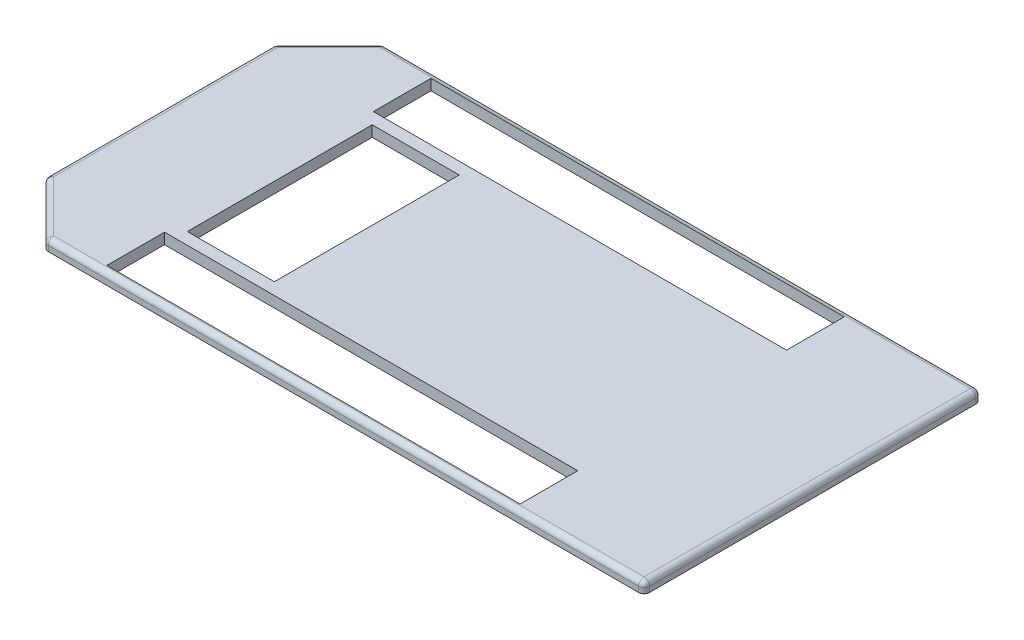
ISO-10303-21;
HEADER;
FILE_DESCRIPTION(('STEP AP214'),'2;1');
FILE_NAME('part.step','',(''),(''),'','','');
FILE_SCHEMA(('AUTOMOTIVE_DESIGN { 1 0 10303 214 1 1 1 1 }'));
ENDSEC;
DATA;
#1=APPLICATION_CONTEXT('core data for automotive mechanical design processes');
#2=APPLICATION_PROTOCOL_DEFINITION('international standard','automotive_design',2000,#1);
#3=PRODUCT_CONTEXT('',#1,'mechanical');
#4=PRODUCT('Part','Part','',(#3));
#5=PRODUCT_RELATED_PRODUCT_CATEGORY('part','',(#4));
#6=PRODUCT_DEFINITION_FORMATION('','',#4);
#7=PRODUCT_DEFINITION_CONTEXT('part definition',#1,'design');
#8=PRODUCT_DEFINITION('design','',#6,#7);
#9=PRODUCT_DEFINITION_SHAPE('','',#8);
#10=(LENGTH_UNIT() NAMED_UNIT(*) SI_UNIT(.MILLI.,.METRE.));
#11=(NAMED_UNIT(*) PLANE_ANGLE_UNIT() SI_UNIT($,.RADIAN.));
#12=(NAMED_UNIT(*) SI_UNIT($,.STERADIAN.) SOLID_ANGLE_UNIT());
#13=UNCERTAINTY_MEASURE_WITH_UNIT(LENGTH_MEASURE(1.E-05),#10,'distance_accuracy_value','');
#14=(GEOMETRIC_REPRESENTATION_CONTEXT(3) GLOBAL_UNCERTAINTY_ASSIGNED_CONTEXT((#13)) GLOBAL_UNIT_ASSIGNED_CONTEXT((#10,
#11,#12)) REPRESENTATION_CONTEXT('',''));
#15=CARTESIAN_POINT('',(0.,0.,0.));
#16=DIRECTION('',(0.,0.,1.));
#17=DIRECTION('',(1.,0.,0.));
#18=AXIS2_PLACEMENT_3D('',#15,#16,#17);
#19=CARTESIAN_POINT('',(300.,10.,-155.));
#20=DIRECTION('',(-1.,0.,0.));
#21=DIRECTION('',(0.,0.,1.));
#22=AXIS2_PLACEMENT_3D('',#19,#20,#21);
#23=PLANE('',#22);
#24=DIRECTION('',(0.,0.,-1.));
#25=VECTOR('',#24,1.);
#26=CARTESIAN_POINT('',(300.,0.,-155.));
#27=LINE('',#26,#25);
#28=CARTESIAN_POINT('',(300.,0.,150.));
#29=VERTEX_POINT('',#28);
#30=CARTESIAN_POINT('',(300.,0.,-150.));
#31=VERTEX_POINT('',#30);
#32=EDGE_CURVE('E358',#29,#31,#27,.T.);
#33=ORIENTED_EDGE('',*,*,#32,.T.);
#34=DIRECTION('',(0.,-1.,0.));
#35=VECTOR('',#34,1.);
#36=CARTESIAN_POINT('',(300.,10.,-150.));
#37=LINE('',#36,#35);
#38=CARTESIAN_POINT('',(300.,5.,-150.));
#39=VERTEX_POINT('',#38);
#40=EDGE_CURVE('E453',#31,#39,#37,.F.);
#41=ORIENTED_EDGE('',*,*,#40,.T.);
#42=DIRECTION('',(0.,0.,-1.));
#43=VECTOR('',#42,1.);
#44=CARTESIAN_POINT('',(300.,5.,155.));
#45=LINE('',#44,#43);
#46=CARTESIAN_POINT('',(300.,5.,150.));
#47=VERTEX_POINT('',#46);
#48=EDGE_CURVE('E450',#39,#47,#45,.F.);
#49=ORIENTED_EDGE('',*,*,#48,.T.);
#50=DIRECTION('',(0.,-1.,0.));
#51=VECTOR('',#50,1.);
#52=CARTESIAN_POINT('',(300.,10.,150.));
#53=LINE('',#52,#51);
#54=EDGE_CURVE('E447',#47,#29,#53,.T.);
#55=ORIENTED_EDGE('',*,*,#54,.T.);
#56=EDGE_LOOP('',(#33,#41,#49,#55));
#57=FACE_BOUND('',#56,.T.);
#58=ADVANCED_FACE('F38',(#57),#23,.F.);
#59=CARTESIAN_POINT('',(-250.,10.,-155.));
#60=DIRECTION('',(0.,0.,1.));
#61=DIRECTION('',(1.,0.,0.));
#62=AXIS2_PLACEMENT_3D('',#59,#60,#61);
#63=PLANE('',#62);
#64=DIRECTION('',(-1.,0.,0.));
#65=VECTOR('',#64,1.);
#66=CARTESIAN_POINT('',(300.,5.,-155.));
#67=LINE('',#66,#65);
#68=CARTESIAN_POINT('',(-247.928932188134,5.,-155.));
#69=VERTEX_POINT('',#68);
#70=CARTESIAN_POINT('',(295.,5.,-155.));
#71=VERTEX_POINT('',#70);
#72=EDGE_CURVE('E441',#69,#71,#67,.F.);
#73=ORIENTED_EDGE('',*,*,#72,.T.);
#74=DIRECTION('',(0.,-1.,0.));
#75=VECTOR('',#74,1.);
#76=CARTESIAN_POINT('',(295.,10.,-155.));
#77=LINE('',#76,#75);
#78=CARTESIAN_POINT('',(295.,0.,-155.));
#79=VERTEX_POINT('',#78);
#80=EDGE_CURVE('E444',#71,#79,#77,.T.);
#81=ORIENTED_EDGE('',*,*,#80,.T.);
#82=DIRECTION('',(-1.,0.,0.));
#83=VECTOR('',#82,1.);
#84=CARTESIAN_POINT('',(-250.,0.,-155.));
#85=LINE('',#84,#83);
#86=CARTESIAN_POINT('',(-247.928932188134,0.,-155.));
#87=VERTEX_POINT('',#86);
#88=EDGE_CURVE('E362',#79,#87,#85,.T.);
#89=ORIENTED_EDGE('',*,*,#88,.T.);
#90=DIRECTION('',(0.,-1.,0.));
#91=VECTOR('',#90,1.);
#92=CARTESIAN_POINT('',(-247.928932188134,10.,-155.));
#93=LINE('',#92,#91);
#94=EDGE_CURVE('E438',#87,#69,#93,.F.);
#95=ORIENTED_EDGE('',*,*,#94,.T.);
#96=EDGE_LOOP('',(#73,#81,#89,#95));
#97=FACE_BOUND('',#96,.T.);
#98=ADVANCED_FACE('F574',(#97),#63,.F.);
#99=CARTESIAN_POINT('',(-300.,10.,-105.));
#100=DIRECTION('',(0.707106781186548,0.,0.707106781186547));
#101=DIRECTION('',(0.707106781186547,0.,-0.707106781186548));
#102=AXIS2_PLACEMENT_3D('',#99,#100,#101);
#103=PLANE('',#102);
#104=DIRECTION('',(-0.707106781186547,0.,0.707106781186548));
#105=VECTOR('',#104,1.);
#106=CARTESIAN_POINT('',(-250.,5.,-155.));
#107=LINE('',#106,#105);
#108=CARTESIAN_POINT('',(-298.535533905933,5.,-106.464466094067));
#109=VERTEX_POINT('',#108);
#110=CARTESIAN_POINT('',(-251.464466094067,5.,-153.535533905933));
#111=VERTEX_POINT('',#110);
#112=EDGE_CURVE('E432',#109,#111,#107,.F.);
#113=ORIENTED_EDGE('',*,*,#112,.T.);
#114=DIRECTION('',(0.,-1.,0.));
#115=VECTOR('',#114,1.);
#116=CARTESIAN_POINT('',(-251.464466094067,10.,-153.535533905933));
#117=LINE('',#116,#115);
#118=CARTESIAN_POINT('',(-251.464466094067,0.,-153.535533905933));
#119=VERTEX_POINT('',#118);
#120=EDGE_CURVE('E435',#111,#119,#117,.T.);
#121=ORIENTED_EDGE('',*,*,#120,.T.);
#122=DIRECTION('',(-0.707106781186547,0.,0.707106781186548));
#123=VECTOR('',#122,1.);
#124=CARTESIAN_POINT('',(-300.,0.,-105.));
#125=LINE('',#124,#123);
#126=CARTESIAN_POINT('',(-298.535533905933,0.,-106.464466094067));
#127=VERTEX_POINT('',#126);
#128=EDGE_CURVE('E366',#119,#127,#125,.T.);
#129=ORIENTED_EDGE('',*,*,#128,.T.);
#130=DIRECTION('',(0.,-1.,0.));
#131=VECTOR('',#130,1.);
#132=CARTESIAN_POINT('',(-298.535533905933,10.,-106.464466094067));
#133=LINE('',#132,#131);
#134=EDGE_CURVE('E429',#127,#109,#133,.F.);
#135=ORIENTED_EDGE('',*,*,#134,.T.);
#136=EDGE_LOOP('',(#113,#121,#129,#135));
#137=FACE_BOUND('',#136,.T.);
#138=ADVANCED_FACE('F561',(#137),#103,.F.);
#139=CARTESIAN_POINT('',(-300.,10.,-105.));
#140=DIRECTION('',(1.,0.,0.));
#141=DIRECTION('',(0.,0.,-1.));
#142=AXIS2_PLACEMENT_3D('',#139,#140,#141);
#143=PLANE('',#142);
#144=DIRECTION('',(0.,0.,1.));
#145=VECTOR('',#144,1.);
#146=CARTESIAN_POINT('',(-300.,5.,-105.));
#147=LINE('',#146,#145);
#148=CARTESIAN_POINT('',(-300.,5.,102.928932188135));
#149=VERTEX_POINT('',#148);
#150=CARTESIAN_POINT('',(-300.,5.,-102.928932188135));
#151=VERTEX_POINT('',#150);
#152=EDGE_CURVE('E423',#149,#151,#147,.F.);
#153=ORIENTED_EDGE('',*,*,#152,.T.);
#154=DIRECTION('',(0.,-1.,0.));
#155=VECTOR('',#154,1.);
#156=CARTESIAN_POINT('',(-300.,10.,-102.928932188135));
#157=LINE('',#156,#155);
#158=CARTESIAN_POINT('',(-300.,0.,-102.928932188135));
#159=VERTEX_POINT('',#158);
#160=EDGE_CURVE('E426',#151,#159,#157,.T.);
#161=ORIENTED_EDGE('',*,*,#160,.T.);
#162=DIRECTION('',(0.,0.,1.));
#163=VECTOR('',#162,1.);
#164=CARTESIAN_POINT('',(-300.,0.,-105.));
#165=LINE('',#164,#163);
#166=CARTESIAN_POINT('',(-300.,0.,102.928932188135));
#167=VERTEX_POINT('',#166);
#168=EDGE_CURVE('E370',#159,#167,#165,.T.);
#169=ORIENTED_EDGE('',*,*,#168,.T.);
#170=DIRECTION('',(0.,-1.,0.));
#171=VECTOR('',#170,1.);
#172=CARTESIAN_POINT('',(-300.,10.,102.928932188135));
#173=LINE('',#172,#171);
#174=EDGE_CURVE('E420',#167,#149,#173,.F.);
#175=ORIENTED_EDGE('',*,*,#174,.T.);
#176=EDGE_LOOP('',(#153,#161,#169,#175));
#177=FACE_BOUND('',#176,.T.);
#178=ADVANCED_FACE('F650',(#177),#143,.F.);
#179=CARTESIAN_POINT('',(-300.,10.,105.));
#180=DIRECTION('',(0.707106781186548,0.,-0.707106781186547));
#181=DIRECTION('',(-0.707106781186547,0.,-0.707106781186548));
#182=AXIS2_PLACEMENT_3D('',#179,#180,#181);
#183=PLANE('',#182);
#184=DIRECTION('',(0.707106781186547,0.,0.707106781186548));
#185=VECTOR('',#184,1.);
#186=CARTESIAN_POINT('',(-300.,5.,105.));
#187=LINE('',#186,#185);
#188=CARTESIAN_POINT('',(-251.464466094067,5.,153.535533905933));
#189=VERTEX_POINT('',#188);
#190=CARTESIAN_POINT('',(-298.535533905933,5.,106.464466094067));
#191=VERTEX_POINT('',#190);
#192=EDGE_CURVE('E414',#189,#191,#187,.F.);
#193=ORIENTED_EDGE('',*,*,#192,.T.);
#194=DIRECTION('',(0.,-1.,0.));
#195=VECTOR('',#194,1.);
#196=CARTESIAN_POINT('',(-298.535533905933,10.,106.464466094067));
#197=LINE('',#196,#195);
#198=CARTESIAN_POINT('',(-298.535533905933,0.,106.464466094067));
#199=VERTEX_POINT('',#198);
#200=EDGE_CURVE('E417',#191,#199,#197,.T.);
#201=ORIENTED_EDGE('',*,*,#200,.T.);
#202=DIRECTION('',(0.707106781186547,0.,0.707106781186548));
#203=VECTOR('',#202,1.);
#204=CARTESIAN_POINT('',(-300.,0.,105.));
#205=LINE('',#204,#203);
#206=CARTESIAN_POINT('',(-251.464466094067,0.,153.535533905933));
#207=VERTEX_POINT('',#206);
#208=EDGE_CURVE('E374',#199,#207,#205,.T.);
#209=ORIENTED_EDGE('',*,*,#208,.T.);
#210=DIRECTION('',(0.,-1.,0.));
#211=VECTOR('',#210,1.);
#212=CARTESIAN_POINT('',(-251.464466094067,10.,153.535533905933));
#213=LINE('',#212,#211);
#214=EDGE_CURVE('E411',#207,#189,#213,.F.);
#215=ORIENTED_EDGE('',*,*,#214,.T.);
#216=EDGE_LOOP('',(#193,#201,#209,#215));
#217=FACE_BOUND('',#216,.T.);
#218=ADVANCED_FACE('F613',(#217),#183,.F.);
#219=CARTESIAN_POINT('',(-250.,10.,155.));
#220=DIRECTION('',(0.,0.,-1.));
#221=DIRECTION('',(-1.,0.,0.));
#222=AXIS2_PLACEMENT_3D('',#219,#220,#221);
#223=PLANE('',#222);
#224=DIRECTION('',(1.,0.,0.));
#225=VECTOR('',#224,1.);
#226=CARTESIAN_POINT('',(-250.,5.,155.));
#227=LINE('',#226,#225);
#228=CARTESIAN_POINT('',(295.,5.,155.));
#229=VERTEX_POINT('',#228);
#230=CARTESIAN_POINT('',(-247.928932188134,5.,155.));
#231=VERTEX_POINT('',#230);
#232=EDGE_CURVE('E404',#229,#231,#227,.F.);
#233=ORIENTED_EDGE('',*,*,#232,.T.);
#234=DIRECTION('',(0.,-1.,0.));
#235=VECTOR('',#234,1.);
#236=CARTESIAN_POINT('',(-247.928932188134,10.,155.));
#237=LINE('',#236,#235);
#238=CARTESIAN_POINT('',(-247.928932188134,0.,155.));
#239=VERTEX_POINT('',#238);
#240=EDGE_CURVE('E408',#231,#239,#237,.T.);
#241=ORIENTED_EDGE('',*,*,#240,.T.);
#242=DIRECTION('',(1.,0.,0.));
#243=VECTOR('',#242,1.);
#244=CARTESIAN_POINT('',(-250.,0.,155.));
#245=LINE('',#244,#243);
#246=CARTESIAN_POINT('',(295.,0.,155.));
#247=VERTEX_POINT('',#246);
#248=EDGE_CURVE('E378',#239,#247,#245,.T.);
#249=ORIENTED_EDGE('',*,*,#248,.T.);
#250=DIRECTION('',(0.,-1.,0.));
#251=VECTOR('',#250,1.);
#252=CARTESIAN_POINT('',(295.,10.,155.));
#253=LINE('',#252,#251);
#254=EDGE_CURVE('E401',#247,#229,#253,.F.);
#255=ORIENTED_EDGE('',*,*,#254,.T.);
#256=EDGE_LOOP('',(#233,#241,#249,#255));
#257=FACE_BOUND('',#256,.T.);
#258=ADVANCED_FACE('F604',(#257),#223,.F.);
#259=CARTESIAN_POINT('',(0.,10.,0.));
#260=DIRECTION('',(0.,1.,0.));
#261=DIRECTION('',(0.,0.,1.));
#262=AXIS2_PLACEMENT_3D('',#259,#260,#261);
#263=PLANE('',#262);
#264=DIRECTION('',(0.,0.,1.));
#265=VECTOR('',#264,1.);
#266=CARTESIAN_POINT('',(180.,10.,-149.));
#267=LINE('',#266,#265);
#268=CARTESIAN_POINT('',(180.,10.,-149.));
#269=VERTEX_POINT('',#268);
#270=CARTESIAN_POINT('',(180.,10.,-96.));
#271=VERTEX_POINT('',#270);
#272=EDGE_CURVE('E223',#269,#271,#267,.T.);
#273=ORIENTED_EDGE('',*,*,#272,.T.);
#274=DIRECTION('',(-1.,0.,0.));
#275=VECTOR('',#274,1.);
#276=CARTESIAN_POINT('',(180.,10.,-96.));
#277=LINE('',#276,#275);
#278=CARTESIAN_POINT('',(-200.,10.,-96.0000000000001));
#279=VERTEX_POINT('',#278);
#280=EDGE_CURVE('E235',#271,#279,#277,.T.);
#281=ORIENTED_EDGE('',*,*,#280,.T.);
#282=DIRECTION('',(0.,0.,-1.));
#283=VECTOR('',#282,1.);
#284=CARTESIAN_POINT('',(-200.,10.,-149.));
#285=LINE('',#284,#283);
#286=CARTESIAN_POINT('',(-200.,10.,-149.));
#287=VERTEX_POINT('',#286);
#288=EDGE_CURVE('E56',#279,#287,#285,.T.);
#289=ORIENTED_EDGE('',*,*,#288,.T.);
#290=DIRECTION('',(1.,0.,0.));
#291=VECTOR('',#290,1.);
#292=CARTESIAN_POINT('',(180.,10.,-149.));
#293=LINE('',#292,#291);
#294=EDGE_CURVE('E232',#287,#269,#293,.T.);
#295=ORIENTED_EDGE('',*,*,#294,.T.);
#296=EDGE_LOOP('',(#273,#281,#289,#295));
#297=FACE_BOUND('',#296,.T.);
#298=DIRECTION('',(0.,0.,1.));
#299=VECTOR('',#298,1.);
#300=CARTESIAN_POINT('',(180.,10.,149.));
#301=LINE('',#300,#299);
#302=CARTESIAN_POINT('',(180.,10.,96.));
#303=VERTEX_POINT('',#302);
#304=CARTESIAN_POINT('',(180.,10.,149.));
#305=VERTEX_POINT('',#304);
#306=EDGE_CURVE('E273',#303,#305,#301,.T.);
#307=ORIENTED_EDGE('',*,*,#306,.T.);
#308=DIRECTION('',(-1.,0.,0.));
#309=VECTOR('',#308,1.);
#310=CARTESIAN_POINT('',(180.,10.,149.));
#311=LINE('',#310,#309);
#312=CARTESIAN_POINT('',(-200.,10.,149.));
#313=VERTEX_POINT('',#312);
#314=EDGE_CURVE('E277',#305,#313,#311,.T.);
#315=ORIENTED_EDGE('',*,*,#314,.T.);
#316=DIRECTION('',(0.,0.,-1.));
#317=VECTOR('',#316,1.);
#318=CARTESIAN_POINT('',(-200.,10.,149.));
#319=LINE('',#318,#317);
#320=CARTESIAN_POINT('',(-200.,10.,96.0000000000001));
#321=VERTEX_POINT('',#320);
#322=EDGE_CURVE('E64',#313,#321,#319,.T.);
#323=ORIENTED_EDGE('',*,*,#322,.T.);
#324=DIRECTION('',(1.,0.,0.));
#325=VECTOR('',#324,1.);
#326=CARTESIAN_POINT('',(180.,10.,96.));
#327=LINE('',#326,#325);
#328=EDGE_CURVE('E284',#321,#303,#327,.T.);
#329=ORIENTED_EDGE('',*,*,#328,.T.);
#330=EDGE_LOOP('',(#307,#315,#323,#329));
#331=FACE_BOUND('',#330,.T.);
#332=DIRECTION('',(0.,0.,-1.));
#333=VECTOR('',#332,1.);
#334=CARTESIAN_POINT('',(-190.,10.,85.));
#335=LINE('',#334,#333);
#336=CARTESIAN_POINT('',(-190.,10.,85.));
#337=VERTEX_POINT('',#336);
#338=CARTESIAN_POINT('',(-190.,10.,-85.));
#339=VERTEX_POINT('',#338);
#340=EDGE_CURVE('E315',#337,#339,#335,.T.);
#341=ORIENTED_EDGE('',*,*,#340,.T.);
#342=DIRECTION('',(1.,0.,0.));
#343=VECTOR('',#342,1.);
#344=CARTESIAN_POINT('',(-190.,10.,-85.));
#345=LINE('',#344,#343);
#346=CARTESIAN_POINT('',(-110.,10.,-85.));
#347=VERTEX_POINT('',#346);
#348=EDGE_CURVE('E319',#339,#347,#345,.T.);
#349=ORIENTED_EDGE('',*,*,#348,.T.);
#350=DIRECTION('',(0.,0.,1.));
#351=VECTOR('',#350,1.);
#352=CARTESIAN_POINT('',(-110.,10.,85.));
#353=LINE('',#352,#351);
#354=CARTESIAN_POINT('',(-110.,10.,85.));
#355=VERTEX_POINT('',#354);
#356=EDGE_CURVE('E324',#347,#355,#353,.T.);
#357=ORIENTED_EDGE('',*,*,#356,.T.);
#358=DIRECTION('',(-1.,0.,0.));
#359=VECTOR('',#358,1.);
#360=CARTESIAN_POINT('',(-190.,10.,85.));
#361=LINE('',#360,#359);
#362=EDGE_CURVE('E328',#355,#337,#361,.T.);
#363=ORIENTED_EDGE('',*,*,#362,.T.);
#364=EDGE_LOOP('',(#341,#349,#357,#363));
#365=FACE_BOUND('',#364,.T.);
#366=DIRECTION('',(0.707106781186547,0.,0.707106781186548));
#367=VECTOR('',#366,1.);
#368=CARTESIAN_POINT('',(-246.464466094067,10.,151.464466094067));
#369=LINE('',#368,#367);
#370=CARTESIAN_POINT('',(-295.,10.,102.928932188135));
#371=VERTEX_POINT('',#370);
#372=CARTESIAN_POINT('',(-247.928932188135,10.,150.));
#373=VERTEX_POINT('',#372);
#374=EDGE_CURVE('E394',#371,#373,#369,.T.);
#375=ORIENTED_EDGE('',*,*,#374,.T.);
#376=DIRECTION('',(1.,0.,0.));
#377=VECTOR('',#376,1.);
#378=CARTESIAN_POINT('',(300.,10.,150.));
#379=LINE('',#378,#377);
#380=CARTESIAN_POINT('',(295.,10.,150.));
#381=VERTEX_POINT('',#380);
#382=EDGE_CURVE('E397',#373,#381,#379,.T.);
#383=ORIENTED_EDGE('',*,*,#382,.T.);
#384=DIRECTION('',(0.,0.,-1.));
#385=VECTOR('',#384,1.);
#386=CARTESIAN_POINT('',(295.,10.,-155.));
#387=LINE('',#386,#385);
#388=CARTESIAN_POINT('',(295.,10.,-150.));
#389=VERTEX_POINT('',#388);
#390=EDGE_CURVE('E382',#381,#389,#387,.T.);
#391=ORIENTED_EDGE('',*,*,#390,.T.);
#392=DIRECTION('',(-1.,0.,0.));
#393=VECTOR('',#392,1.);
#394=CARTESIAN_POINT('',(-250.,10.,-150.));
#395=LINE('',#394,#393);
#396=CARTESIAN_POINT('',(-247.928932188135,10.,-150.));
#397=VERTEX_POINT('',#396);
#398=EDGE_CURVE('E385',#389,#397,#395,.T.);
#399=ORIENTED_EDGE('',*,*,#398,.T.);
#400=DIRECTION('',(-0.707106781186547,0.,0.707106781186548));
#401=VECTOR('',#400,1.);
#402=CARTESIAN_POINT('',(-296.464466094067,10.,-101.464466094067));
#403=LINE('',#402,#401);
#404=CARTESIAN_POINT('',(-295.,10.,-102.928932188135));
#405=VERTEX_POINT('',#404);
#406=EDGE_CURVE('E388',#397,#405,#403,.T.);
#407=ORIENTED_EDGE('',*,*,#406,.T.);
#408=DIRECTION('',(0.,0.,1.));
#409=VECTOR('',#408,1.);
#410=CARTESIAN_POINT('',(-295.,10.,105.));
#411=LINE('',#410,#409);
#412=EDGE_CURVE('E391',#405,#371,#411,.T.);
#413=ORIENTED_EDGE('',*,*,#412,.T.);
#414=EDGE_LOOP('',(#375,#383,#391,#399,#407,#413));
#415=FACE_BOUND('',#414,.T.);
#416=ADVANCED_FACE('F240',(#297,#331,#365,#415),#263,.T.);
#417=CARTESIAN_POINT('',(0.,0.,0.));
#418=DIRECTION('',(0.,1.,0.));
#419=DIRECTION('',(0.,0.,1.));
#420=AXIS2_PLACEMENT_3D('',#417,#418,#419);
#421=PLANE('',#420);
#422=DIRECTION('',(-1.,0.,0.));
#423=VECTOR('',#422,1.);
#424=CARTESIAN_POINT('',(180.,0.,-96.));
#425=LINE('',#424,#423);
#426=CARTESIAN_POINT('',(180.,0.,-96.));
#427=VERTEX_POINT('',#426);
#428=CARTESIAN_POINT('',(-200.,0.,-96.0000000000001));
#429=VERTEX_POINT('',#428);
#430=EDGE_CURVE('E257',#427,#429,#425,.T.);
#431=ORIENTED_EDGE('',*,*,#430,.F.);
#432=DIRECTION('',(0.,0.,1.));
#433=VECTOR('',#432,1.);
#434=CARTESIAN_POINT('',(180.,0.,-149.));
#435=LINE('',#434,#433);
#436=CARTESIAN_POINT('',(180.,0.,-149.));
#437=VERTEX_POINT('',#436);
#438=EDGE_CURVE('E226',#437,#427,#435,.T.);
#439=ORIENTED_EDGE('',*,*,#438,.F.);
#440=DIRECTION('',(1.,0.,0.));
#441=VECTOR('',#440,1.);
#442=CARTESIAN_POINT('',(180.,0.,-149.));
#443=LINE('',#442,#441);
#444=CARTESIAN_POINT('',(-200.,0.,-149.));
#445=VERTEX_POINT('',#444);
#446=EDGE_CURVE('E244',#445,#437,#443,.T.);
#447=ORIENTED_EDGE('',*,*,#446,.F.);
#448=DIRECTION('',(0.,0.,-1.));
#449=VECTOR('',#448,1.);
#450=CARTESIAN_POINT('',(-200.,0.,-149.));
#451=LINE('',#450,#449);
#452=EDGE_CURVE('E248',#429,#445,#451,.T.);
#453=ORIENTED_EDGE('',*,*,#452,.F.);
#454=EDGE_LOOP('',(#431,#439,#447,#453));
#455=FACE_BOUND('',#454,.T.);
#456=DIRECTION('',(-1.,0.,0.));
#457=VECTOR('',#456,1.);
#458=CARTESIAN_POINT('',(180.,0.,149.));
#459=LINE('',#458,#457);
#460=CARTESIAN_POINT('',(180.,0.,149.));
#461=VERTEX_POINT('',#460);
#462=CARTESIAN_POINT('',(-200.,0.,149.));
#463=VERTEX_POINT('',#462);
#464=EDGE_CURVE('E292',#461,#463,#459,.T.);
#465=ORIENTED_EDGE('',*,*,#464,.F.);
#466=DIRECTION('',(0.,0.,1.));
#467=VECTOR('',#466,1.);
#468=CARTESIAN_POINT('',(180.,0.,149.));
#469=LINE('',#468,#467);
#470=CARTESIAN_POINT('',(180.,0.,96.));
#471=VERTEX_POINT('',#470);
#472=EDGE_CURVE('E289',#471,#461,#469,.T.);
#473=ORIENTED_EDGE('',*,*,#472,.F.);
#474=DIRECTION('',(1.,0.,0.));
#475=VECTOR('',#474,1.);
#476=CARTESIAN_POINT('',(180.,0.,96.));
#477=LINE('',#476,#475);
#478=CARTESIAN_POINT('',(-200.,0.,96.0000000000001));
#479=VERTEX_POINT('',#478);
#480=EDGE_CURVE('E278',#479,#471,#477,.T.);
#481=ORIENTED_EDGE('',*,*,#480,.F.);
#482=DIRECTION('',(0.,0.,-1.));
#483=VECTOR('',#482,1.);
#484=CARTESIAN_POINT('',(-200.,0.,149.));
#485=LINE('',#484,#483);
#486=EDGE_CURVE('E297',#463,#479,#485,.T.);
#487=ORIENTED_EDGE('',*,*,#486,.F.);
#488=EDGE_LOOP('',(#465,#473,#481,#487));
#489=FACE_BOUND('',#488,.T.);
#490=DIRECTION('',(1.,0.,0.));
#491=VECTOR('',#490,1.);
#492=CARTESIAN_POINT('',(-190.,0.,-85.));
#493=LINE('',#492,#491);
#494=CARTESIAN_POINT('',(-190.,0.,-85.));
#495=VERTEX_POINT('',#494);
#496=CARTESIAN_POINT('',(-110.,0.,-85.));
#497=VERTEX_POINT('',#496);
#498=EDGE_CURVE('E336',#495,#497,#493,.T.);
#499=ORIENTED_EDGE('',*,*,#498,.F.);
#500=DIRECTION('',(0.,0.,-1.));
#501=VECTOR('',#500,1.);
#502=CARTESIAN_POINT('',(-190.,0.,85.));
#503=LINE('',#502,#501);
#504=CARTESIAN_POINT('',(-190.,0.,85.));
#505=VERTEX_POINT('',#504);
#506=EDGE_CURVE('E333',#505,#495,#503,.T.);
#507=ORIENTED_EDGE('',*,*,#506,.F.);
#508=DIRECTION('',(-1.,0.,0.));
#509=VECTOR('',#508,1.);
#510=CARTESIAN_POINT('',(-190.,0.,85.));
#511=LINE('',#510,#509);
#512=CARTESIAN_POINT('',(-110.,0.,85.));
#513=VERTEX_POINT('',#512);
#514=EDGE_CURVE('E320',#513,#505,#511,.T.);
#515=ORIENTED_EDGE('',*,*,#514,.F.);
#516=DIRECTION('',(0.,0.,1.));
#517=VECTOR('',#516,1.);
#518=CARTESIAN_POINT('',(-110.,0.,85.));
#519=LINE('',#518,#517);
#520=EDGE_CURVE('E340',#497,#513,#519,.T.);
#521=ORIENTED_EDGE('',*,*,#520,.F.);
#522=EDGE_LOOP('',(#499,#507,#515,#521));
#523=FACE_BOUND('',#522,.T.);
#524=ORIENTED_EDGE('',*,*,#88,.F.);
#525=CARTESIAN_POINT('',(295.,0.,-150.));
#526=DIRECTION('',(0.,1.,0.));
#527=DIRECTION('',(0.,0.,1.));
#528=AXIS2_PLACEMENT_3D('',#525,#526,#527);
#529=CIRCLE('',#528,5.);
#530=EDGE_CURVE('E11',#79,#31,#529,.F.);
#531=ORIENTED_EDGE('',*,*,#530,.T.);
#532=ORIENTED_EDGE('',*,*,#32,.F.);
#533=CARTESIAN_POINT('',(295.,0.,150.));
#534=DIRECTION('',(0.,1.,0.));
#535=DIRECTION('',(0.,0.,1.));
#536=AXIS2_PLACEMENT_3D('',#533,#534,#535);
#537=CIRCLE('',#536,5.);
#538=EDGE_CURVE('E456',#29,#247,#537,.F.);
#539=ORIENTED_EDGE('',*,*,#538,.T.);
#540=ORIENTED_EDGE('',*,*,#248,.F.);
#541=CARTESIAN_POINT('',(-247.928932188134,0.,150.));
#542=DIRECTION('',(0.,1.,0.));
#543=DIRECTION('',(0.,0.,1.));
#544=AXIS2_PLACEMENT_3D('',#541,#542,#543);
#545=CIRCLE('',#544,5.);
#546=EDGE_CURVE('E459',#239,#207,#545,.F.);
#547=ORIENTED_EDGE('',*,*,#546,.T.);
#548=ORIENTED_EDGE('',*,*,#208,.F.);
#549=CARTESIAN_POINT('',(-295.,0.,102.928932188135));
#550=DIRECTION('',(0.,1.,0.));
#551=DIRECTION('',(0.,0.,1.));
#552=AXIS2_PLACEMENT_3D('',#549,#550,#551);
#553=CIRCLE('',#552,5.);
#554=EDGE_CURVE('E462',#199,#167,#553,.F.);
#555=ORIENTED_EDGE('',*,*,#554,.T.);
#556=ORIENTED_EDGE('',*,*,#168,.F.);
#557=CARTESIAN_POINT('',(-295.,0.,-102.928932188135));
#558=DIRECTION('',(0.,1.,0.));
#559=DIRECTION('',(0.,0.,1.));
#560=AXIS2_PLACEMENT_3D('',#557,#558,#559);
#561=CIRCLE('',#560,5.);
#562=EDGE_CURVE('E465',#159,#127,#561,.F.);
#563=ORIENTED_EDGE('',*,*,#562,.T.);
#564=ORIENTED_EDGE('',*,*,#128,.F.);
#565=CARTESIAN_POINT('',(-247.928932188134,0.,-150.));
#566=DIRECTION('',(0.,1.,0.));
#567=DIRECTION('',(0.,0.,1.));
#568=AXIS2_PLACEMENT_3D('',#565,#566,#567);
#569=CIRCLE('',#568,5.);
#570=EDGE_CURVE('E48',#119,#87,#569,.F.);
#571=ORIENTED_EDGE('',*,*,#570,.T.);
#572=EDGE_LOOP('',(#524,#531,#532,#539,#540,#547,#548,#555,#556,#563,#564,#571));
#573=FACE_BOUND('',#572,.T.);
#574=ADVANCED_FACE('F571',(#455,#489,#523,#573),#421,.F.);
#575=CARTESIAN_POINT('',(-295.,10.,-102.928932188135));
#576=DIRECTION('',(0.,-1.,0.));
#577=DIRECTION('',(0.,0.,-1.));
#578=AXIS2_PLACEMENT_3D('',#575,#576,#577);
#579=CYLINDRICAL_SURFACE('',#578,5.);
#580=ORIENTED_EDGE('',*,*,#562,.F.);
#581=ORIENTED_EDGE('',*,*,#160,.F.);
#582=CARTESIAN_POINT('',(-295.,5.,-102.928932188135));
#583=DIRECTION('',(0.,1.,0.));
#584=DIRECTION('',(0.,0.,1.));
#585=AXIS2_PLACEMENT_3D('',#582,#583,#584);
#586=CIRCLE('',#585,5.);
#587=EDGE_CURVE('E42',#109,#151,#586,.T.);
#588=ORIENTED_EDGE('',*,*,#587,.F.);
#589=ORIENTED_EDGE('',*,*,#134,.F.);
#590=EDGE_LOOP('',(#580,#581,#588,#589));
#591=FACE_BOUND('',#590,.T.);
#592=ADVANCED_FACE('F40',(#591),#579,.T.);
#593=CARTESIAN_POINT('',(-198.964466094067,5.,-198.964466094067));
#594=DIRECTION('',(0.707106781186547,0.,-0.707106781186548));
#595=DIRECTION('',(-0.707106781186548,0.,-0.707106781186547));
#596=AXIS2_PLACEMENT_3D('',#593,#594,#595);
#597=CYLINDRICAL_SURFACE('',#596,5.);
#598=CARTESIAN_POINT('',(-247.928932188135,5.,-150.));
#599=DIRECTION('',(0.707106781186548,0.,-0.707106781186548));
#600=DIRECTION('',(-0.707106781186548,0.,-0.707106781186548));
#601=AXIS2_PLACEMENT_3D('',#598,#599,#600);
#602=CIRCLE('',#601,5.);
#603=EDGE_CURVE('E527',#111,#397,#602,.T.);
#604=ORIENTED_EDGE('',*,*,#603,.F.);
#605=ORIENTED_EDGE('',*,*,#112,.F.);
#606=CARTESIAN_POINT('',(-295.,5.,-102.928932188135));
#607=DIRECTION('',(-0.707106781186542,0.,0.707106781186553));
#608=DIRECTION('',(0.707106781186553,0.,0.707106781186542));
#609=AXIS2_PLACEMENT_3D('',#606,#607,#608);
#610=CIRCLE('',#609,5.);
#611=EDGE_CURVE('E530',#405,#109,#610,.T.);
#612=ORIENTED_EDGE('',*,*,#611,.F.);
#613=ORIENTED_EDGE('',*,*,#406,.F.);
#614=EDGE_LOOP('',(#604,#605,#612,#613));
#615=FACE_BOUND('',#614,.T.);
#616=ADVANCED_FACE('F558',(#615),#597,.T.);
#617=CARTESIAN_POINT('',(-247.928932188134,10.,-150.));
#618=DIRECTION('',(0.,-1.,0.));
#619=DIRECTION('',(0.,0.,-1.));
#620=AXIS2_PLACEMENT_3D('',#617,#618,#619);
#621=CYLINDRICAL_SURFACE('',#620,5.);
#622=ORIENTED_EDGE('',*,*,#570,.F.);
#623=ORIENTED_EDGE('',*,*,#120,.F.);
#624=CARTESIAN_POINT('',(-247.928932188134,5.,-150.));
#625=DIRECTION('',(0.,1.,0.));
#626=DIRECTION('',(0.,0.,1.));
#627=AXIS2_PLACEMENT_3D('',#624,#625,#626);
#628=CIRCLE('',#627,5.);
#629=EDGE_CURVE('E523',#69,#111,#628,.T.);
#630=ORIENTED_EDGE('',*,*,#629,.F.);
#631=ORIENTED_EDGE('',*,*,#94,.F.);
#632=EDGE_LOOP('',(#622,#623,#630,#631));
#633=FACE_BOUND('',#632,.T.);
#634=ADVANCED_FACE('F566',(#633),#621,.T.);
#635=CARTESIAN_POINT('',(-295.,5.,-102.928932188135));
#636=DIRECTION('',(0.,0.,1.));
#637=DIRECTION('',(1.,0.,0.));
#638=AXIS2_PLACEMENT_3D('',#635,#636,#637);
#639=SPHERICAL_SURFACE('',#638,5.);
#640=ORIENTED_EDGE('',*,*,#611,.T.);
#641=ORIENTED_EDGE('',*,*,#587,.T.);
#642=CARTESIAN_POINT('',(-295.,5.,-102.928932188135));
#643=DIRECTION('',(0.,0.,-1.));
#644=DIRECTION('',(0.,1.,0.));
#645=AXIS2_PLACEMENT_3D('',#642,#643,#644);
#646=CIRCLE('',#645,5.);
#647=EDGE_CURVE('E519',#405,#151,#646,.F.);
#648=ORIENTED_EDGE('',*,*,#647,.F.);
#649=EDGE_LOOP('',(#640,#641,#648));
#650=FACE_BOUND('',#649,.T.);
#651=ADVANCED_FACE('F539',(#650),#639,.T.);
#652=CARTESIAN_POINT('',(-247.928932188134,5.,-150.));
#653=DIRECTION('',(0.,0.,1.));
#654=DIRECTION('',(1.,0.,0.));
#655=AXIS2_PLACEMENT_3D('',#652,#653,#654);
#656=SPHERICAL_SURFACE('',#655,5.);
#657=ORIENTED_EDGE('',*,*,#629,.T.);
#658=ORIENTED_EDGE('',*,*,#603,.T.);
#659=CARTESIAN_POINT('',(-247.928932188135,5.,-150.));
#660=DIRECTION('',(-1.,0.,0.));
#661=DIRECTION('',(0.,0.,1.));
#662=AXIS2_PLACEMENT_3D('',#659,#660,#661);
#663=CIRCLE('',#662,5.);
#664=EDGE_CURVE('E515',#69,#397,#663,.F.);
#665=ORIENTED_EDGE('',*,*,#664,.F.);
#666=EDGE_LOOP('',(#657,#658,#665));
#667=FACE_BOUND('',#666,.T.);
#668=ADVANCED_FACE('F870',(#667),#656,.T.);
#669=CARTESIAN_POINT('',(-295.,10.,102.928932188135));
#670=DIRECTION('',(0.,-1.,0.));
#671=DIRECTION('',(0.,0.,-1.));
#672=AXIS2_PLACEMENT_3D('',#669,#670,#671);
#673=CYLINDRICAL_SURFACE('',#672,5.);
#674=ORIENTED_EDGE('',*,*,#554,.F.);
#675=ORIENTED_EDGE('',*,*,#200,.F.);
#676=CARTESIAN_POINT('',(-295.,5.,102.928932188135));
#677=DIRECTION('',(0.,1.,0.));
#678=DIRECTION('',(0.,0.,1.));
#679=AXIS2_PLACEMENT_3D('',#676,#677,#678);
#680=CIRCLE('',#679,5.);
#681=EDGE_CURVE('E511',#149,#191,#680,.T.);
#682=ORIENTED_EDGE('',*,*,#681,.F.);
#683=ORIENTED_EDGE('',*,*,#174,.F.);
#684=EDGE_LOOP('',(#674,#675,#682,#683));
#685=FACE_BOUND('',#684,.T.);
#686=ADVANCED_FACE('F617',(#685),#673,.T.);
#687=CARTESIAN_POINT('',(-295.,5.,0.));
#688=DIRECTION('',(0.,0.,-1.));
#689=DIRECTION('',(-1.,0.,0.));
#690=AXIS2_PLACEMENT_3D('',#687,#688,#689);
#691=CYLINDRICAL_SURFACE('',#690,5.);
#692=ORIENTED_EDGE('',*,*,#647,.T.);
#693=ORIENTED_EDGE('',*,*,#152,.F.);
#694=CARTESIAN_POINT('',(-295.,5.,102.928932188135));
#695=DIRECTION('',(0.,0.,1.));
#696=DIRECTION('',(1.,0.,0.));
#697=AXIS2_PLACEMENT_3D('',#694,#695,#696);
#698=CIRCLE('',#697,5.);
#699=EDGE_CURVE('E507',#371,#149,#698,.T.);
#700=ORIENTED_EDGE('',*,*,#699,.F.);
#701=ORIENTED_EDGE('',*,*,#412,.F.);
#702=EDGE_LOOP('',(#692,#693,#700,#701));
#703=FACE_BOUND('',#702,.T.);
#704=ADVANCED_FACE('F546',(#703),#691,.T.);
#705=CARTESIAN_POINT('',(0.,5.,-150.));
#706=DIRECTION('',(1.,0.,0.));
#707=DIRECTION('',(0.,0.,-1.));
#708=AXIS2_PLACEMENT_3D('',#705,#706,#707);
#709=CYLINDRICAL_SURFACE('',#708,5.);
#710=ORIENTED_EDGE('',*,*,#664,.T.);
#711=ORIENTED_EDGE('',*,*,#398,.F.);
#712=CARTESIAN_POINT('',(295.,5.,-150.));
#713=DIRECTION('',(1.,0.,0.));
#714=DIRECTION('',(0.,1.,0.));
#715=AXIS2_PLACEMENT_3D('',#712,#713,#714);
#716=CIRCLE('',#715,5.);
#717=EDGE_CURVE('E503',#71,#389,#716,.T.);
#718=ORIENTED_EDGE('',*,*,#717,.F.);
#719=ORIENTED_EDGE('',*,*,#72,.F.);
#720=EDGE_LOOP('',(#710,#711,#718,#719));
#721=FACE_BOUND('',#720,.T.);
#722=ADVANCED_FACE('F584',(#721),#709,.T.);
#723=CARTESIAN_POINT('',(295.,10.,-150.));
#724=DIRECTION('',(0.,-1.,0.));
#725=DIRECTION('',(0.,0.,-1.));
#726=AXIS2_PLACEMENT_3D('',#723,#724,#725);
#727=CYLINDRICAL_SURFACE('',#726,5.);
#728=ORIENTED_EDGE('',*,*,#530,.F.);
#729=ORIENTED_EDGE('',*,*,#80,.F.);
#730=CARTESIAN_POINT('',(295.,5.,-150.));
#731=DIRECTION('',(0.,1.,0.));
#732=DIRECTION('',(0.,0.,1.));
#733=AXIS2_PLACEMENT_3D('',#730,#731,#732);
#734=CIRCLE('',#733,5.);
#735=EDGE_CURVE('E499',#39,#71,#734,.T.);
#736=ORIENTED_EDGE('',*,*,#735,.F.);
#737=ORIENTED_EDGE('',*,*,#40,.F.);
#738=EDGE_LOOP('',(#728,#729,#736,#737));
#739=FACE_BOUND('',#738,.T.);
#740=ADVANCED_FACE('F580',(#739),#727,.T.);
#741=CARTESIAN_POINT('',(-295.,5.,102.928932188135));
#742=DIRECTION('',(0.,0.,1.));
#743=DIRECTION('',(1.,0.,0.));
#744=AXIS2_PLACEMENT_3D('',#741,#742,#743);
#745=SPHERICAL_SURFACE('',#744,5.);
#746=ORIENTED_EDGE('',*,*,#699,.T.);
#747=ORIENTED_EDGE('',*,*,#681,.T.);
#748=CARTESIAN_POINT('',(-295.,5.,102.928932188135));
#749=DIRECTION('',(-0.707106781186546,0.,-0.707106781186549));
#750=DIRECTION('',(-0.707106781186549,0.,0.707106781186546));
#751=AXIS2_PLACEMENT_3D('',#748,#749,#750);
#752=CIRCLE('',#751,5.);
#753=EDGE_CURVE('E495',#371,#191,#752,.F.);
#754=ORIENTED_EDGE('',*,*,#753,.F.);
#755=EDGE_LOOP('',(#746,#747,#754));
#756=FACE_BOUND('',#755,.T.);
#757=ADVANCED_FACE('F620',(#756),#745,.T.);
#758=CARTESIAN_POINT('',(295.,5.,-150.));
#759=DIRECTION('',(0.,0.,1.));
#760=DIRECTION('',(1.,0.,0.));
#761=AXIS2_PLACEMENT_3D('',#758,#759,#760);
#762=SPHERICAL_SURFACE('',#761,5.);
#763=ORIENTED_EDGE('',*,*,#735,.T.);
#764=ORIENTED_EDGE('',*,*,#717,.T.);
#765=CARTESIAN_POINT('',(295.,5.,-150.));
#766=DIRECTION('',(0.,0.,-1.));
#767=DIRECTION('',(-1.,0.,0.));
#768=AXIS2_PLACEMENT_3D('',#765,#766,#767);
#769=CIRCLE('',#768,5.);
#770=EDGE_CURVE('E491',#39,#389,#769,.F.);
#771=ORIENTED_EDGE('',*,*,#770,.F.);
#772=EDGE_LOOP('',(#763,#764,#771));
#773=FACE_BOUND('',#772,.T.);
#774=ADVANCED_FACE('F586',(#773),#762,.T.);
#775=CARTESIAN_POINT('',(-247.928932188134,10.,150.));
#776=DIRECTION('',(0.,-1.,0.));
#777=DIRECTION('',(0.,0.,-1.));
#778=AXIS2_PLACEMENT_3D('',#775,#776,#777);
#779=CYLINDRICAL_SURFACE('',#778,5.);
#780=ORIENTED_EDGE('',*,*,#546,.F.);
#781=ORIENTED_EDGE('',*,*,#240,.F.);
#782=CARTESIAN_POINT('',(-247.928932188135,5.,150.));
#783=DIRECTION('',(0.,1.,0.));
#784=DIRECTION('',(0.,0.,1.));
#785=AXIS2_PLACEMENT_3D('',#782,#783,#784);
#786=CIRCLE('',#785,5.);
#787=EDGE_CURVE('E487',#189,#231,#786,.T.);
#788=ORIENTED_EDGE('',*,*,#787,.F.);
#789=ORIENTED_EDGE('',*,*,#214,.F.);
#790=EDGE_LOOP('',(#780,#781,#788,#789));
#791=FACE_BOUND('',#790,.T.);
#792=ADVANCED_FACE('F608',(#791),#779,.T.);
#793=CARTESIAN_POINT('',(-198.964466094067,5.,198.964466094067));
#794=DIRECTION('',(-0.707106781186547,0.,-0.707106781186548));
#795=DIRECTION('',(-0.707106781186548,0.,0.707106781186547));
#796=AXIS2_PLACEMENT_3D('',#793,#794,#795);
#797=CYLINDRICAL_SURFACE('',#796,5.);
#798=ORIENTED_EDGE('',*,*,#753,.T.);
#799=ORIENTED_EDGE('',*,*,#192,.F.);
#800=CARTESIAN_POINT('',(-247.928932188135,5.,150.));
#801=DIRECTION('',(0.70710678118655,0.,0.707106781186545));
#802=DIRECTION('',(0.707106781186545,0.,-0.70710678118655));
#803=AXIS2_PLACEMENT_3D('',#800,#801,#802);
#804=CIRCLE('',#803,5.);
#805=EDGE_CURVE('E483',#373,#189,#804,.T.);
#806=ORIENTED_EDGE('',*,*,#805,.F.);
#807=ORIENTED_EDGE('',*,*,#374,.F.);
#808=EDGE_LOOP('',(#798,#799,#806,#807));
#809=FACE_BOUND('',#808,.T.);
#810=ADVANCED_FACE('F622',(#809),#797,.T.);
#811=CARTESIAN_POINT('',(295.,5.,0.));
#812=DIRECTION('',(0.,0.,1.));
#813=DIRECTION('',(1.,0.,0.));
#814=AXIS2_PLACEMENT_3D('',#811,#812,#813);
#815=CYLINDRICAL_SURFACE('',#814,5.);
#816=ORIENTED_EDGE('',*,*,#770,.T.);
#817=ORIENTED_EDGE('',*,*,#390,.F.);
#818=CARTESIAN_POINT('',(295.,5.,150.));
#819=DIRECTION('',(0.,0.,1.));
#820=DIRECTION('',(1.,0.,0.));
#821=AXIS2_PLACEMENT_3D('',#818,#819,#820);
#822=CIRCLE('',#821,5.);
#823=EDGE_CURVE('E479',#47,#381,#822,.T.);
#824=ORIENTED_EDGE('',*,*,#823,.F.);
#825=ORIENTED_EDGE('',*,*,#48,.F.);
#826=EDGE_LOOP('',(#816,#817,#824,#825));
#827=FACE_BOUND('',#826,.T.);
#828=ADVANCED_FACE('F591',(#827),#815,.T.);
#829=CARTESIAN_POINT('',(295.,10.,150.));
#830=DIRECTION('',(0.,-1.,0.));
#831=DIRECTION('',(0.,0.,-1.));
#832=AXIS2_PLACEMENT_3D('',#829,#830,#831);
#833=CYLINDRICAL_SURFACE('',#832,5.);
#834=ORIENTED_EDGE('',*,*,#538,.F.);
#835=ORIENTED_EDGE('',*,*,#54,.F.);
#836=CARTESIAN_POINT('',(295.,5.,150.));
#837=DIRECTION('',(0.,1.,0.));
#838=DIRECTION('',(0.,0.,1.));
#839=AXIS2_PLACEMENT_3D('',#836,#837,#838);
#840=CIRCLE('',#839,5.);
#841=EDGE_CURVE('E475',#229,#47,#840,.T.);
#842=ORIENTED_EDGE('',*,*,#841,.F.);
#843=ORIENTED_EDGE('',*,*,#254,.F.);
#844=EDGE_LOOP('',(#834,#835,#842,#843));
#845=FACE_BOUND('',#844,.T.);
#846=ADVANCED_FACE('F598',(#845),#833,.T.);
#847=CARTESIAN_POINT('',(-247.928932188134,5.,150.));
#848=DIRECTION('',(0.,0.,1.));
#849=DIRECTION('',(1.,0.,0.));
#850=AXIS2_PLACEMENT_3D('',#847,#848,#849);
#851=SPHERICAL_SURFACE('',#850,5.);
#852=ORIENTED_EDGE('',*,*,#805,.T.);
#853=ORIENTED_EDGE('',*,*,#787,.T.);
#854=CARTESIAN_POINT('',(-247.928932188134,5.,150.));
#855=DIRECTION('',(-1.,0.,0.));
#856=DIRECTION('',(0.,-1.,0.));
#857=AXIS2_PLACEMENT_3D('',#854,#855,#856);
#858=CIRCLE('',#857,5.);
#859=EDGE_CURVE('E472',#373,#231,#858,.F.);
#860=ORIENTED_EDGE('',*,*,#859,.F.);
#861=EDGE_LOOP('',(#852,#853,#860));
#862=FACE_BOUND('',#861,.T.);
#863=ADVANCED_FACE('F626',(#862),#851,.T.);
#864=CARTESIAN_POINT('',(295.,5.,150.));
#865=DIRECTION('',(0.,0.,1.));
#866=DIRECTION('',(1.,0.,0.));
#867=AXIS2_PLACEMENT_3D('',#864,#865,#866);
#868=SPHERICAL_SURFACE('',#867,5.);
#869=ORIENTED_EDGE('',*,*,#841,.T.);
#870=ORIENTED_EDGE('',*,*,#823,.T.);
#871=CARTESIAN_POINT('',(295.,5.,150.));
#872=DIRECTION('',(1.,0.,0.));
#873=DIRECTION('',(0.,0.,-1.));
#874=AXIS2_PLACEMENT_3D('',#871,#872,#873);
#875=CIRCLE('',#874,5.);
#876=EDGE_CURVE('E267',#229,#381,#875,.F.);
#877=ORIENTED_EDGE('',*,*,#876,.F.);
#878=EDGE_LOOP('',(#869,#870,#877));
#879=FACE_BOUND('',#878,.T.);
#880=ADVANCED_FACE('F631',(#879),#868,.T.);
#881=CARTESIAN_POINT('',(0.,5.,150.));
#882=DIRECTION('',(-1.,0.,0.));
#883=DIRECTION('',(0.,0.,1.));
#884=AXIS2_PLACEMENT_3D('',#881,#882,#883);
#885=CYLINDRICAL_SURFACE('',#884,5.);
#886=ORIENTED_EDGE('',*,*,#859,.T.);
#887=ORIENTED_EDGE('',*,*,#232,.F.);
#888=ORIENTED_EDGE('',*,*,#876,.T.);
#889=ORIENTED_EDGE('',*,*,#382,.F.);
#890=EDGE_LOOP('',(#886,#887,#888,#889));
#891=FACE_BOUND('',#890,.T.);
#892=ADVANCED_FACE('F628',(#891),#885,.T.);
#893=CARTESIAN_POINT('',(-190.,10.,85.));
#894=DIRECTION('',(-1.,0.,0.));
#895=DIRECTION('',(0.,0.,1.));
#896=AXIS2_PLACEMENT_3D('',#893,#894,#895);
#897=PLANE('',#896);
#898=ORIENTED_EDGE('',*,*,#506,.T.);
#899=DIRECTION('',(0.,-1.,0.));
#900=VECTOR('',#899,1.);
#901=CARTESIAN_POINT('',(-190.,10.,-85.));
#902=LINE('',#901,#900);
#903=EDGE_CURVE('E332',#339,#495,#902,.T.);
#904=ORIENTED_EDGE('',*,*,#903,.F.);
#905=ORIENTED_EDGE('',*,*,#340,.F.);
#906=DIRECTION('',(0.,-1.,0.));
#907=VECTOR('',#906,1.);
#908=CARTESIAN_POINT('',(-190.,10.,85.));
#909=LINE('',#908,#907);
#910=EDGE_CURVE('E293',#337,#505,#909,.T.);
#911=ORIENTED_EDGE('',*,*,#910,.T.);
#912=EDGE_LOOP('',(#898,#904,#905,#911));
#913=FACE_BOUND('',#912,.T.);
#914=ADVANCED_FACE('F638',(#913),#897,.F.);
#915=CARTESIAN_POINT('',(-190.,10.,85.));
#916=DIRECTION('',(0.,0.,1.));
#917=DIRECTION('',(1.,0.,0.));
#918=AXIS2_PLACEMENT_3D('',#915,#916,#917);
#919=PLANE('',#918);
#920=ORIENTED_EDGE('',*,*,#514,.T.);
#921=ORIENTED_EDGE('',*,*,#910,.F.);
#922=ORIENTED_EDGE('',*,*,#362,.F.);
#923=DIRECTION('',(0.,-1.,0.));
#924=VECTOR('',#923,1.);
#925=CARTESIAN_POINT('',(-110.,10.,85.));
#926=LINE('',#925,#924);
#927=EDGE_CURVE('E349',#355,#513,#926,.T.);
#928=ORIENTED_EDGE('',*,*,#927,.T.);
#929=EDGE_LOOP('',(#920,#921,#922,#928));
#930=FACE_BOUND('',#929,.T.);
#931=ADVANCED_FACE('F665',(#930),#919,.F.);
#932=CARTESIAN_POINT('',(-110.,10.,85.));
#933=DIRECTION('',(1.,0.,0.));
#934=DIRECTION('',(0.,0.,-1.));
#935=AXIS2_PLACEMENT_3D('',#932,#933,#934);
#936=PLANE('',#935);
#937=ORIENTED_EDGE('',*,*,#520,.T.);
#938=ORIENTED_EDGE('',*,*,#927,.F.);
#939=ORIENTED_EDGE('',*,*,#356,.F.);
#940=DIRECTION('',(0.,-1.,0.));
#941=VECTOR('',#940,1.);
#942=CARTESIAN_POINT('',(-110.,10.,-85.));
#943=LINE('',#942,#941);
#944=EDGE_CURVE('E352',#347,#497,#943,.T.);
#945=ORIENTED_EDGE('',*,*,#944,.T.);
#946=EDGE_LOOP('',(#937,#938,#939,#945));
#947=FACE_BOUND('',#946,.T.);
#948=ADVANCED_FACE('F671',(#947),#936,.F.);
#949=CARTESIAN_POINT('',(-190.,10.,-85.));
#950=DIRECTION('',(0.,0.,-1.));
#951=DIRECTION('',(-1.,0.,0.));
#952=AXIS2_PLACEMENT_3D('',#949,#950,#951);
#953=PLANE('',#952);
#954=ORIENTED_EDGE('',*,*,#498,.T.);
#955=ORIENTED_EDGE('',*,*,#944,.F.);
#956=ORIENTED_EDGE('',*,*,#348,.F.);
#957=ORIENTED_EDGE('',*,*,#903,.T.);
#958=EDGE_LOOP('',(#954,#955,#956,#957));
#959=FACE_BOUND('',#958,.T.);
#960=ADVANCED_FACE('F667',(#959),#953,.F.);
#961=CARTESIAN_POINT('',(180.,10.,149.));
#962=DIRECTION('',(1.,0.,0.));
#963=DIRECTION('',(0.,0.,-1.));
#964=AXIS2_PLACEMENT_3D('',#961,#962,#963);
#965=PLANE('',#964);
#966=ORIENTED_EDGE('',*,*,#472,.T.);
#967=DIRECTION('',(0.,-1.,0.));
#968=VECTOR('',#967,1.);
#969=CARTESIAN_POINT('',(180.,10.,149.));
#970=LINE('',#969,#968);
#971=EDGE_CURVE('E288',#305,#461,#970,.T.);
#972=ORIENTED_EDGE('',*,*,#971,.F.);
#973=ORIENTED_EDGE('',*,*,#306,.F.);
#974=DIRECTION('',(0.,-1.,0.));
#975=VECTOR('',#974,1.);
#976=CARTESIAN_POINT('',(180.,10.,96.));
#977=LINE('',#976,#975);
#978=EDGE_CURVE('E258',#303,#471,#977,.T.);
#979=ORIENTED_EDGE('',*,*,#978,.T.);
#980=EDGE_LOOP('',(#966,#972,#973,#979));
#981=FACE_BOUND('',#980,.T.);
#982=ADVANCED_FACE('F670',(#981),#965,.F.);
#983=CARTESIAN_POINT('',(180.,10.,96.));
#984=DIRECTION('',(0.,0.,-1.));
#985=DIRECTION('',(-1.,0.,0.));
#986=AXIS2_PLACEMENT_3D('',#983,#984,#985);
#987=PLANE('',#986);
#988=ORIENTED_EDGE('',*,*,#480,.T.);
#989=ORIENTED_EDGE('',*,*,#978,.F.);
#990=ORIENTED_EDGE('',*,*,#328,.F.);
#991=DIRECTION('',(0.,-1.,0.));
#992=VECTOR('',#991,1.);
#993=CARTESIAN_POINT('',(-200.,10.,96.0000000000001));
#994=LINE('',#993,#992);
#995=EDGE_CURVE('E306',#321,#479,#994,.T.);
#996=ORIENTED_EDGE('',*,*,#995,.T.);
#997=EDGE_LOOP('',(#988,#989,#990,#996));
#998=FACE_BOUND('',#997,.T.);
#999=ADVANCED_FACE('F681',(#998),#987,.F.);
#1000=CARTESIAN_POINT('',(-200.,10.,149.));
#1001=DIRECTION('',(-1.,0.,0.));
#1002=DIRECTION('',(0.,0.,1.));
#1003=AXIS2_PLACEMENT_3D('',#1000,#1001,#1002);
#1004=PLANE('',#1003);
#1005=ORIENTED_EDGE('',*,*,#486,.T.);
#1006=ORIENTED_EDGE('',*,*,#995,.F.);
#1007=ORIENTED_EDGE('',*,*,#322,.F.);
#1008=DIRECTION('',(0.,-1.,0.));
#1009=VECTOR('',#1008,1.);
#1010=CARTESIAN_POINT('',(-200.,10.,149.));
#1011=LINE('',#1010,#1009);
#1012=EDGE_CURVE('E309',#313,#463,#1011,.T.);
#1013=ORIENTED_EDGE('',*,*,#1012,.T.);
#1014=EDGE_LOOP('',(#1005,#1006,#1007,#1013));
#1015=FACE_BOUND('',#1014,.T.);
#1016=ADVANCED_FACE('F686',(#1015),#1004,.F.);
#1017=CARTESIAN_POINT('',(180.,10.,149.));
#1018=DIRECTION('',(0.,0.,1.));
#1019=DIRECTION('',(1.,0.,0.));
#1020=AXIS2_PLACEMENT_3D('',#1017,#1018,#1019);
#1021=PLANE('',#1020);
#1022=ORIENTED_EDGE('',*,*,#464,.T.);
#1023=ORIENTED_EDGE('',*,*,#1012,.F.);
#1024=ORIENTED_EDGE('',*,*,#314,.F.);
#1025=ORIENTED_EDGE('',*,*,#971,.T.);
#1026=EDGE_LOOP('',(#1022,#1023,#1024,#1025));
#1027=FACE_BOUND('',#1026,.T.);
#1028=ADVANCED_FACE('F683',(#1027),#1021,.F.);
#1029=CARTESIAN_POINT('',(180.,10.,-149.));
#1030=DIRECTION('',(1.,0.,0.));
#1031=DIRECTION('',(0.,0.,-1.));
#1032=AXIS2_PLACEMENT_3D('',#1029,#1030,#1031);
#1033=PLANE('',#1032);
#1034=ORIENTED_EDGE('',*,*,#438,.T.);
#1035=DIRECTION('',(0.,-1.,0.));
#1036=VECTOR('',#1035,1.);
#1037=CARTESIAN_POINT('',(180.,10.,-96.));
#1038=LINE('',#1037,#1036);
#1039=EDGE_CURVE('E219',#271,#427,#1038,.T.);
#1040=ORIENTED_EDGE('',*,*,#1039,.F.);
#1041=ORIENTED_EDGE('',*,*,#272,.F.);
#1042=DIRECTION('',(0.,-1.,0.));
#1043=VECTOR('',#1042,1.);
#1044=CARTESIAN_POINT('',(180.,10.,-149.));
#1045=LINE('',#1044,#1043);
#1046=EDGE_CURVE('E264',#269,#437,#1045,.T.);
#1047=ORIENTED_EDGE('',*,*,#1046,.T.);
#1048=EDGE_LOOP('',(#1034,#1040,#1041,#1047));
#1049=FACE_BOUND('',#1048,.T.);
#1050=ADVANCED_FACE('F221',(#1049),#1033,.F.);
#1051=CARTESIAN_POINT('',(180.,10.,-149.));
#1052=DIRECTION('',(0.,0.,-1.));
#1053=DIRECTION('',(-1.,0.,0.));
#1054=AXIS2_PLACEMENT_3D('',#1051,#1052,#1053);
#1055=PLANE('',#1054);
#1056=ORIENTED_EDGE('',*,*,#446,.T.);
#1057=ORIENTED_EDGE('',*,*,#1046,.F.);
#1058=ORIENTED_EDGE('',*,*,#294,.F.);
#1059=DIRECTION('',(0.,-1.,0.));
#1060=VECTOR('',#1059,1.);
#1061=CARTESIAN_POINT('',(-200.,10.,-149.));
#1062=LINE('',#1061,#1060);
#1063=EDGE_CURVE('E268',#287,#445,#1062,.T.);
#1064=ORIENTED_EDGE('',*,*,#1063,.T.);
#1065=EDGE_LOOP('',(#1056,#1057,#1058,#1064));
#1066=FACE_BOUND('',#1065,.T.);
#1067=ADVANCED_FACE('F695',(#1066),#1055,.F.);
#1068=CARTESIAN_POINT('',(-200.,10.,-149.));
#1069=DIRECTION('',(-1.,0.,0.));
#1070=DIRECTION('',(0.,0.,1.));
#1071=AXIS2_PLACEMENT_3D('',#1068,#1069,#1070);
#1072=PLANE('',#1071);
#1073=ORIENTED_EDGE('',*,*,#452,.T.);
#1074=ORIENTED_EDGE('',*,*,#1063,.F.);
#1075=ORIENTED_EDGE('',*,*,#288,.F.);
#1076=DIRECTION('',(0.,-1.,0.));
#1077=VECTOR('',#1076,1.);
#1078=CARTESIAN_POINT('',(-200.,10.,-96.0000000000001));
#1079=LINE('',#1078,#1077);
#1080=EDGE_CURVE('E231',#279,#429,#1079,.T.);
#1081=ORIENTED_EDGE('',*,*,#1080,.T.);
#1082=EDGE_LOOP('',(#1073,#1074,#1075,#1081));
#1083=FACE_BOUND('',#1082,.T.);
#1084=ADVANCED_FACE('F698',(#1083),#1072,.F.);
#1085=CARTESIAN_POINT('',(180.,10.,-96.));
#1086=DIRECTION('',(0.,0.,1.));
#1087=DIRECTION('',(1.,0.,0.));
#1088=AXIS2_PLACEMENT_3D('',#1085,#1086,#1087);
#1089=PLANE('',#1088);
#1090=ORIENTED_EDGE('',*,*,#430,.T.);
#1091=ORIENTED_EDGE('',*,*,#1080,.F.);
#1092=ORIENTED_EDGE('',*,*,#280,.F.);
#1093=ORIENTED_EDGE('',*,*,#1039,.T.);
#1094=EDGE_LOOP('',(#1090,#1091,#1092,#1093));
#1095=FACE_BOUND('',#1094,.T.);
#1096=ADVANCED_FACE('F236',(#1095),#1089,.F.);
#1097=CLOSED_SHELL('',(#58,#98,#138,#178,#218,#258,#416,#574,#592,#616,#634,#651,#668,#686,#704,
#722,#740,#757,#774,#792,#810,#828,#846,#863,#880,#892,#914,#931,#948,#960,#982,#999,#1016,
#1028,#1050,#1067,#1084,#1096));
#1098=MANIFOLD_SOLID_BREP('B2',#1097);
#1099=ADVANCED_BREP_SHAPE_REPRESENTATION('',(#18,#1098),#14);
#1100=SHAPE_DEFINITION_REPRESENTATION(#9,#1099);
ENDSEC;
END-ISO-10303-21;
